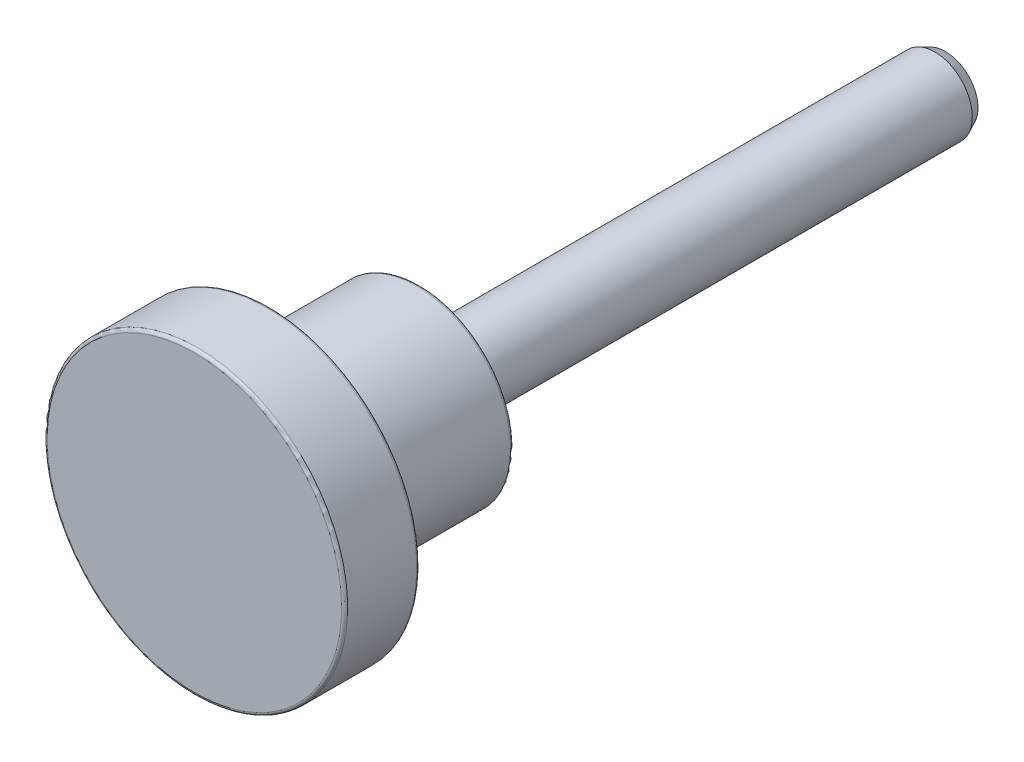
ISO-10303-21;
HEADER;
FILE_DESCRIPTION(('STEP AP214'),'2;1');
FILE_NAME('part.step','',(''),(''),'','','');
FILE_SCHEMA(('AUTOMOTIVE_DESIGN { 1 0 10303 214 1 1 1 1 }'));
ENDSEC;
DATA;
#1=APPLICATION_CONTEXT('core data for automotive mechanical design processes');
#2=APPLICATION_PROTOCOL_DEFINITION('international standard','automotive_design',2000,#1);
#3=PRODUCT_CONTEXT('',#1,'mechanical');
#4=PRODUCT('Part','Part','',(#3));
#5=PRODUCT_RELATED_PRODUCT_CATEGORY('part','',(#4));
#6=PRODUCT_DEFINITION_FORMATION('','',#4);
#7=PRODUCT_DEFINITION_CONTEXT('part definition',#1,'design');
#8=PRODUCT_DEFINITION('design','',#6,#7);
#9=PRODUCT_DEFINITION_SHAPE('','',#8);
#10=(LENGTH_UNIT() NAMED_UNIT(*) SI_UNIT(.MILLI.,.METRE.));
#11=(NAMED_UNIT(*) PLANE_ANGLE_UNIT() SI_UNIT($,.RADIAN.));
#12=(NAMED_UNIT(*) SI_UNIT($,.STERADIAN.) SOLID_ANGLE_UNIT());
#13=UNCERTAINTY_MEASURE_WITH_UNIT(LENGTH_MEASURE(1.E-05),#10,'distance_accuracy_value','');
#14=(GEOMETRIC_REPRESENTATION_CONTEXT(3) GLOBAL_UNCERTAINTY_ASSIGNED_CONTEXT((#13)) GLOBAL_UNIT_ASSIGNED_CONTEXT((#10,
#11,#12)) REPRESENTATION_CONTEXT('',''));
#15=CARTESIAN_POINT('',(0.,0.,0.));
#16=DIRECTION('',(0.,0.,1.));
#17=DIRECTION('',(1.,0.,0.));
#18=AXIS2_PLACEMENT_3D('',#15,#16,#17);
#19=CARTESIAN_POINT('',(0.,0.,8.5598));
#20=DIRECTION('',(0.,0.,-1.));
#21=DIRECTION('',(0.,1.,0.));
#22=AXIS2_PLACEMENT_3D('',#19,#20,#21);
#23=CYLINDRICAL_SURFACE('',#22,3.175);
#24=CARTESIAN_POINT('',(0.,0.,22.225));
#25=DIRECTION('',(0.,0.,1.));
#26=DIRECTION('',(0.,-1.,0.));
#27=AXIS2_PLACEMENT_3D('',#24,#25,#26);
#28=CIRCLE('',#27,3.175);
#29=CARTESIAN_POINT('',(0.,-3.175,22.225));
#30=VERTEX_POINT('',#29);
#31=EDGE_CURVE('E65',#30,#30,#28,.F.);
#32=ORIENTED_EDGE('',*,*,#31,.T.);
#33=EDGE_LOOP('',(#32));
#34=FACE_BOUND('',#33,.T.);
#35=CARTESIAN_POINT('',(0.,0.,-21.3178571428572));
#36=DIRECTION('',(0.,0.,1.));
#37=DIRECTION('',(0.,-1.,0.));
#38=AXIS2_PLACEMENT_3D('',#35,#36,#37);
#39=CIRCLE('',#38,3.175);
#40=CARTESIAN_POINT('',(0.,-3.17500000000001,-21.3178571428572));
#41=VERTEX_POINT('',#40);
#42=EDGE_CURVE('E74',#41,#41,#39,.T.);
#43=ORIENTED_EDGE('',*,*,#42,.T.);
#44=EDGE_LOOP('',(#43));
#45=FACE_BOUND('',#44,.T.);
#46=ADVANCED_FACE('F39',(#34,#45),#23,.T.);
#47=CARTESIAN_POINT('',(0.,7.9375,22.225));
#48=DIRECTION('',(0.,0.,1.));
#49=DIRECTION('',(0.,-1.,0.));
#50=AXIS2_PLACEMENT_3D('',#47,#48,#49);
#51=PLANE('',#50);
#52=CARTESIAN_POINT('',(0.,0.,22.225));
#53=DIRECTION('',(0.,0.,1.));
#54=DIRECTION('',(0.,-1.,0.));
#55=AXIS2_PLACEMENT_3D('',#52,#53,#54);
#56=CIRCLE('',#55,7.6835);
#57=CARTESIAN_POINT('',(0.,-7.6835,22.225));
#58=VERTEX_POINT('',#57);
#59=EDGE_CURVE('E59',#58,#58,#56,.F.);
#60=ORIENTED_EDGE('',*,*,#59,.T.);
#61=EDGE_LOOP('',(#60));
#62=FACE_BOUND('',#61,.T.);
#63=ORIENTED_EDGE('',*,*,#31,.F.);
#64=EDGE_LOOP('',(#63));
#65=FACE_BOUND('',#64,.T.);
#66=ADVANCED_FACE('F95',(#62,#65),#51,.F.);
#67=CARTESIAN_POINT('',(0.,0.,22.225));
#68=DIRECTION('',(0.,0.,1.));
#69=DIRECTION('',(0.,-1.,0.));
#70=AXIS2_PLACEMENT_3D('',#67,#68,#69);
#71=CYLINDRICAL_SURFACE('',#70,7.9375);
#72=CARTESIAN_POINT('',(0.,0.,22.479));
#73=DIRECTION('',(0.,0.,1.));
#74=DIRECTION('',(0.,-1.,0.));
#75=AXIS2_PLACEMENT_3D('',#72,#73,#74);
#76=CIRCLE('',#75,7.9375);
#77=CARTESIAN_POINT('',(0.,-7.9375,22.479));
#78=VERTEX_POINT('',#77);
#79=EDGE_CURVE('E62',#78,#78,#76,.T.);
#80=ORIENTED_EDGE('',*,*,#79,.T.);
#81=EDGE_LOOP('',(#80));
#82=FACE_BOUND('',#81,.T.);
#83=CARTESIAN_POINT('',(0.,0.,34.925));
#84=DIRECTION('',(0.,0.,1.));
#85=DIRECTION('',(0.,-1.,0.));
#86=AXIS2_PLACEMENT_3D('',#83,#84,#85);
#87=CIRCLE('',#86,7.9375);
#88=CARTESIAN_POINT('',(0.,-7.9375,34.925));
#89=VERTEX_POINT('',#88);
#90=EDGE_CURVE('E68',#89,#89,#87,.T.);
#91=ORIENTED_EDGE('',*,*,#90,.F.);
#92=EDGE_LOOP('',(#91));
#93=FACE_BOUND('',#92,.T.);
#94=ADVANCED_FACE('F101',(#82,#93),#71,.T.);
#95=CARTESIAN_POINT('',(0.,7.9375,34.925));
#96=DIRECTION('',(0.,0.,1.));
#97=DIRECTION('',(0.,-1.,0.));
#98=AXIS2_PLACEMENT_3D('',#95,#96,#97);
#99=PLANE('',#98);
#100=CARTESIAN_POINT('',(0.,0.,34.925));
#101=DIRECTION('',(0.,0.,1.));
#102=DIRECTION('',(0.,-1.,0.));
#103=AXIS2_PLACEMENT_3D('',#100,#101,#102);
#104=CIRCLE('',#103,12.446);
#105=CARTESIAN_POINT('',(0.,-12.446,34.925));
#106=VERTEX_POINT('',#105);
#107=EDGE_CURVE('E46',#106,#106,#104,.F.);
#108=ORIENTED_EDGE('',*,*,#107,.T.);
#109=EDGE_LOOP('',(#108));
#110=FACE_BOUND('',#109,.T.);
#111=ORIENTED_EDGE('',*,*,#90,.T.);
#112=EDGE_LOOP('',(#111));
#113=FACE_BOUND('',#112,.T.);
#114=ADVANCED_FACE('F120',(#110,#113),#99,.F.);
#115=CARTESIAN_POINT('',(0.,0.,22.225));
#116=DIRECTION('',(0.,0.,1.));
#117=DIRECTION('',(0.,-1.,0.));
#118=AXIS2_PLACEMENT_3D('',#115,#116,#117);
#119=CYLINDRICAL_SURFACE('',#118,12.7);
#120=CARTESIAN_POINT('',(0.,0.,35.179));
#121=DIRECTION('',(0.,0.,1.));
#122=DIRECTION('',(0.,-1.,0.));
#123=AXIS2_PLACEMENT_3D('',#120,#121,#122);
#124=CIRCLE('',#123,12.7);
#125=CARTESIAN_POINT('',(0.,-12.7,35.179));
#126=VERTEX_POINT('',#125);
#127=EDGE_CURVE('E50',#126,#126,#124,.T.);
#128=ORIENTED_EDGE('',*,*,#127,.T.);
#129=EDGE_LOOP('',(#128));
#130=FACE_BOUND('',#129,.T.);
#131=CARTESIAN_POINT('',(0.,0.,41.021));
#132=DIRECTION('',(0.,0.,-1.));
#133=DIRECTION('',(0.,1.,0.));
#134=AXIS2_PLACEMENT_3D('',#131,#132,#133);
#135=CIRCLE('',#134,12.7);
#136=CARTESIAN_POINT('',(0.,12.7,41.021));
#137=VERTEX_POINT('',#136);
#138=EDGE_CURVE('E54',#137,#137,#135,.T.);
#139=ORIENTED_EDGE('',*,*,#138,.T.);
#140=EDGE_LOOP('',(#139));
#141=FACE_BOUND('',#140,.T.);
#142=ADVANCED_FACE('F93',(#130,#141),#119,.T.);
#143=CARTESIAN_POINT('',(0.,12.7,41.275));
#144=DIRECTION('',(0.,0.,-1.));
#145=DIRECTION('',(0.,1.,0.));
#146=AXIS2_PLACEMENT_3D('',#143,#144,#145);
#147=PLANE('',#146);
#148=CARTESIAN_POINT('',(0.,0.,41.275));
#149=DIRECTION('',(0.,0.,-1.));
#150=DIRECTION('',(0.,1.,0.));
#151=AXIS2_PLACEMENT_3D('',#148,#149,#150);
#152=CIRCLE('',#151,12.446);
#153=CARTESIAN_POINT('',(0.,12.446,41.275));
#154=VERTEX_POINT('',#153);
#155=EDGE_CURVE('E11',#154,#154,#152,.F.);
#156=ORIENTED_EDGE('',*,*,#155,.T.);
#157=EDGE_LOOP('',(#156));
#158=FACE_BOUND('',#157,.T.);
#159=ADVANCED_FACE('F82',(#158),#147,.F.);
#160=CARTESIAN_POINT('',(0.,0.,-21.3178571428572));
#161=DIRECTION('',(0.,0.,1.));
#162=DIRECTION('',(0.,-1.,0.));
#163=AXIS2_PLACEMENT_3D('',#160,#161,#162);
#164=CONICAL_SURFACE('',#163,3.175,0.436332312998576);
#165=CARTESIAN_POINT('',(0.,0.,-22.225));
#166=DIRECTION('',(0.,0.,1.));
#167=DIRECTION('',(0.,-1.,0.));
#168=AXIS2_PLACEMENT_3D('',#165,#166,#167);
#169=CIRCLE('',#168,2.75199233867369);
#170=CARTESIAN_POINT('',(0.,-2.75199233867369,-22.225));
#171=VERTEX_POINT('',#170);
#172=EDGE_CURVE('E71',#171,#171,#169,.T.);
#173=ORIENTED_EDGE('',*,*,#172,.T.);
#174=EDGE_LOOP('',(#173));
#175=FACE_BOUND('',#174,.T.);
#176=ORIENTED_EDGE('',*,*,#42,.F.);
#177=EDGE_LOOP('',(#176));
#178=FACE_BOUND('',#177,.T.);
#179=ADVANCED_FACE('F79',(#175,#178),#164,.T.);
#180=CARTESIAN_POINT('',(0.,3.175,-22.225));
#181=DIRECTION('',(0.,0.,-1.));
#182=DIRECTION('',(0.,1.,0.));
#183=AXIS2_PLACEMENT_3D('',#180,#181,#182);
#184=PLANE('',#183);
#185=ORIENTED_EDGE('',*,*,#172,.F.);
#186=EDGE_LOOP('',(#185));
#187=FACE_BOUND('',#186,.T.);
#188=ADVANCED_FACE('F81',(#187),#184,.T.);
#189=CARTESIAN_POINT('',(0.,0.,22.479));
#190=DIRECTION('',(0.,0.,1.));
#191=DIRECTION('',(0.,-1.,0.));
#192=AXIS2_PLACEMENT_3D('',#189,#190,#191);
#193=TOROIDAL_SURFACE('',#192,7.6835,0.254);
#194=ORIENTED_EDGE('',*,*,#59,.F.);
#195=EDGE_LOOP('',(#194));
#196=FACE_BOUND('',#195,.T.);
#197=ORIENTED_EDGE('',*,*,#79,.F.);
#198=EDGE_LOOP('',(#197));
#199=FACE_BOUND('',#198,.T.);
#200=ADVANCED_FACE('F89',(#196,#199),#193,.T.);
#201=CARTESIAN_POINT('',(0.,0.,35.179));
#202=DIRECTION('',(0.,0.,1.));
#203=DIRECTION('',(0.,-1.,0.));
#204=AXIS2_PLACEMENT_3D('',#201,#202,#203);
#205=TOROIDAL_SURFACE('',#204,12.446,0.254);
#206=ORIENTED_EDGE('',*,*,#107,.F.);
#207=EDGE_LOOP('',(#206));
#208=FACE_BOUND('',#207,.T.);
#209=ORIENTED_EDGE('',*,*,#127,.F.);
#210=EDGE_LOOP('',(#209));
#211=FACE_BOUND('',#210,.T.);
#212=ADVANCED_FACE('F107',(#208,#211),#205,.T.);
#213=CARTESIAN_POINT('',(0.,0.,41.021));
#214=DIRECTION('',(0.,0.,-1.));
#215=DIRECTION('',(0.,1.,0.));
#216=AXIS2_PLACEMENT_3D('',#213,#214,#215);
#217=TOROIDAL_SURFACE('',#216,12.446,0.254);
#218=ORIENTED_EDGE('',*,*,#138,.F.);
#219=EDGE_LOOP('',(#218));
#220=FACE_BOUND('',#219,.T.);
#221=ORIENTED_EDGE('',*,*,#155,.F.);
#222=EDGE_LOOP('',(#221));
#223=FACE_BOUND('',#222,.T.);
#224=ADVANCED_FACE('F41',(#220,#223),#217,.T.);
#225=CLOSED_SHELL('',(#46,#66,#94,#114,#142,#159,#179,#188,#200,#212,#224));
#226=MANIFOLD_SOLID_BREP('B2',#225);
#227=ADVANCED_BREP_SHAPE_REPRESENTATION('',(#18,#226),#14);
#228=SHAPE_DEFINITION_REPRESENTATION(#9,#227);
ENDSEC;
END-ISO-10303-21;
